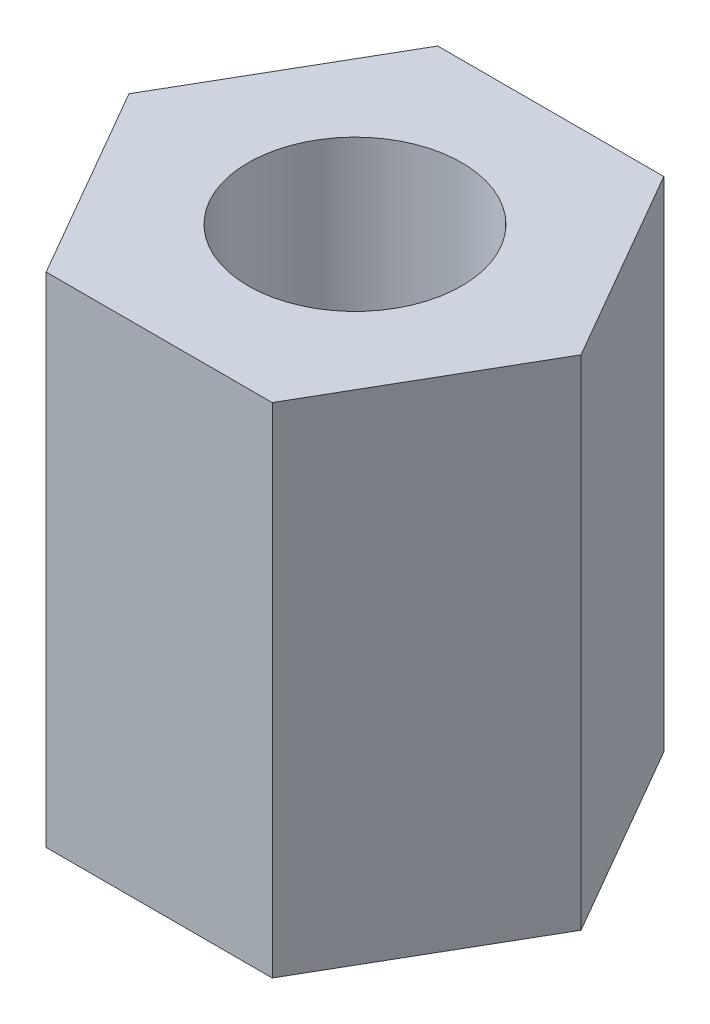
ISO-10303-21;
HEADER;
FILE_DESCRIPTION(('STEP AP214'),'2;1');
FILE_NAME('part.step','',(''),(''),'','','');
FILE_SCHEMA(('AUTOMOTIVE_DESIGN { 1 0 10303 214 1 1 1 1 }'));
ENDSEC;
DATA;
#1=APPLICATION_CONTEXT('core data for automotive mechanical design processes');
#2=APPLICATION_PROTOCOL_DEFINITION('international standard','automotive_design',2000,#1);
#3=PRODUCT_CONTEXT('',#1,'mechanical');
#4=PRODUCT('Part','Part','',(#3));
#5=PRODUCT_RELATED_PRODUCT_CATEGORY('part','',(#4));
#6=PRODUCT_DEFINITION_FORMATION('','',#4);
#7=PRODUCT_DEFINITION_CONTEXT('part definition',#1,'design');
#8=PRODUCT_DEFINITION('design','',#6,#7);
#9=PRODUCT_DEFINITION_SHAPE('','',#8);
#10=(LENGTH_UNIT() NAMED_UNIT(*) SI_UNIT(.MILLI.,.METRE.));
#11=(NAMED_UNIT(*) PLANE_ANGLE_UNIT() SI_UNIT($,.RADIAN.));
#12=(NAMED_UNIT(*) SI_UNIT($,.STERADIAN.) SOLID_ANGLE_UNIT());
#13=UNCERTAINTY_MEASURE_WITH_UNIT(LENGTH_MEASURE(1.E-05),#10,'distance_accuracy_value','');
#14=(GEOMETRIC_REPRESENTATION_CONTEXT(3) GLOBAL_UNCERTAINTY_ASSIGNED_CONTEXT((#13)) GLOBAL_UNIT_ASSIGNED_CONTEXT((#10,
#11,#12)) REPRESENTATION_CONTEXT('',''));
#15=CARTESIAN_POINT('',(0.,0.,0.));
#16=DIRECTION('',(0.,0.,1.));
#17=DIRECTION('',(1.,0.,0.));
#18=AXIS2_PLACEMENT_3D('',#15,#16,#17);
#19=CARTESIAN_POINT('',(0.,7.,0.));
#20=DIRECTION('',(0.,1.,0.));
#21=DIRECTION('',(0.,0.,1.));
#22=AXIS2_PLACEMENT_3D('',#19,#20,#21);
#23=PLANE('',#22);
#24=DIRECTION('',(0.5,0.,-0.866025403784439));
#25=VECTOR('',#24,1.);
#26=CARTESIAN_POINT('',(1.58771324027147,7.,2.75000000000001));
#27=LINE('',#26,#25);
#28=CARTESIAN_POINT('',(1.58771324027147,7.,2.75000000000001));
#29=VERTEX_POINT('',#28);
#30=CARTESIAN_POINT('',(3.17542648054294,7.,0.));
#31=VERTEX_POINT('',#30);
#32=EDGE_CURVE('E152',#29,#31,#27,.T.);
#33=ORIENTED_EDGE('',*,*,#32,.T.);
#34=DIRECTION('',(-0.499999999999999,0.,-0.866025403784439));
#35=VECTOR('',#34,1.);
#36=CARTESIAN_POINT('',(3.17542648054294,7.,0.));
#37=LINE('',#36,#35);
#38=CARTESIAN_POINT('',(1.58771324027147,7.,-2.75000000000001));
#39=VERTEX_POINT('',#38);
#40=EDGE_CURVE('E100',#31,#39,#37,.T.);
#41=ORIENTED_EDGE('',*,*,#40,.T.);
#42=DIRECTION('',(-1.,0.,0.));
#43=VECTOR('',#42,1.);
#44=CARTESIAN_POINT('',(1.58771324027147,7.,-2.75000000000001));
#45=LINE('',#44,#43);
#46=CARTESIAN_POINT('',(-1.58771324027147,7.,-2.75000000000001));
#47=VERTEX_POINT('',#46);
#48=EDGE_CURVE('E113',#39,#47,#45,.T.);
#49=ORIENTED_EDGE('',*,*,#48,.T.);
#50=DIRECTION('',(-0.5,0.,0.866025403784439));
#51=VECTOR('',#50,1.);
#52=CARTESIAN_POINT('',(-1.58771324027147,7.,-2.75000000000001));
#53=LINE('',#52,#51);
#54=CARTESIAN_POINT('',(-3.17542648054295,7.,0.));
#55=VERTEX_POINT('',#54);
#56=EDGE_CURVE('E107',#47,#55,#53,.T.);
#57=ORIENTED_EDGE('',*,*,#56,.T.);
#58=DIRECTION('',(0.5,0.,0.866025403784439));
#59=VECTOR('',#58,1.);
#60=CARTESIAN_POINT('',(-3.17542648054295,7.,0.));
#61=LINE('',#60,#59);
#62=CARTESIAN_POINT('',(-1.58771324027147,7.,2.75000000000001));
#63=VERTEX_POINT('',#62);
#64=EDGE_CURVE('E111',#55,#63,#61,.T.);
#65=ORIENTED_EDGE('',*,*,#64,.T.);
#66=DIRECTION('',(1.,0.,0.));
#67=VECTOR('',#66,1.);
#68=CARTESIAN_POINT('',(-1.58771324027147,7.,2.75000000000001));
#69=LINE('',#68,#67);
#70=EDGE_CURVE('E63',#63,#29,#69,.T.);
#71=ORIENTED_EDGE('',*,*,#70,.T.);
#72=EDGE_LOOP('',(#33,#41,#49,#57,#65,#71));
#73=FACE_BOUND('',#72,.T.);
#74=CARTESIAN_POINT('',(0.,7.,0.));
#75=DIRECTION('',(0.,1.,0.));
#76=DIRECTION('',(0.,0.,1.));
#77=AXIS2_PLACEMENT_3D('',#74,#75,#76);
#78=CIRCLE('',#77,1.5);
#79=CARTESIAN_POINT('',(0.,7.,1.5));
#80=VERTEX_POINT('',#79);
#81=EDGE_CURVE('E140',#80,#80,#78,.T.);
#82=ORIENTED_EDGE('',*,*,#81,.F.);
#83=EDGE_LOOP('',(#82));
#84=FACE_BOUND('',#83,.T.);
#85=ADVANCED_FACE('F45',(#73,#84),#23,.T.);
#86=CARTESIAN_POINT('',(0.,0.,0.));
#87=DIRECTION('',(0.,1.,0.));
#88=DIRECTION('',(0.,0.,1.));
#89=AXIS2_PLACEMENT_3D('',#86,#87,#88);
#90=PLANE('',#89);
#91=DIRECTION('',(0.5,0.,-0.866025403784439));
#92=VECTOR('',#91,1.);
#93=CARTESIAN_POINT('',(1.58771324027147,0.,2.75000000000001));
#94=LINE('',#93,#92);
#95=CARTESIAN_POINT('',(1.58771324027147,0.,2.75000000000001));
#96=VERTEX_POINT('',#95);
#97=CARTESIAN_POINT('',(3.17542648054294,0.,0.));
#98=VERTEX_POINT('',#97);
#99=EDGE_CURVE('E135',#96,#98,#94,.T.);
#100=ORIENTED_EDGE('',*,*,#99,.F.);
#101=DIRECTION('',(1.,0.,0.));
#102=VECTOR('',#101,1.);
#103=CARTESIAN_POINT('',(-1.58771324027147,0.,2.75000000000001));
#104=LINE('',#103,#102);
#105=CARTESIAN_POINT('',(-1.58771324027147,0.,2.75000000000001));
#106=VERTEX_POINT('',#105);
#107=EDGE_CURVE('E92',#106,#96,#104,.T.);
#108=ORIENTED_EDGE('',*,*,#107,.F.);
#109=DIRECTION('',(0.5,0.,0.866025403784439));
#110=VECTOR('',#109,1.);
#111=CARTESIAN_POINT('',(-3.17542648054295,0.,0.));
#112=LINE('',#111,#110);
#113=CARTESIAN_POINT('',(-3.17542648054295,0.,0.));
#114=VERTEX_POINT('',#113);
#115=EDGE_CURVE('E86',#114,#106,#112,.T.);
#116=ORIENTED_EDGE('',*,*,#115,.F.);
#117=DIRECTION('',(-0.5,0.,0.866025403784439));
#118=VECTOR('',#117,1.);
#119=CARTESIAN_POINT('',(-1.58771324027147,0.,-2.75000000000001));
#120=LINE('',#119,#118);
#121=CARTESIAN_POINT('',(-1.58771324027147,0.,-2.75000000000001));
#122=VERTEX_POINT('',#121);
#123=EDGE_CURVE('E122',#122,#114,#120,.T.);
#124=ORIENTED_EDGE('',*,*,#123,.F.);
#125=DIRECTION('',(-1.,0.,0.));
#126=VECTOR('',#125,1.);
#127=CARTESIAN_POINT('',(1.58771324027147,0.,-2.75000000000001));
#128=LINE('',#127,#126);
#129=CARTESIAN_POINT('',(1.58771324027147,0.,-2.75000000000001));
#130=VERTEX_POINT('',#129);
#131=EDGE_CURVE('E143',#130,#122,#128,.T.);
#132=ORIENTED_EDGE('',*,*,#131,.F.);
#133=DIRECTION('',(-0.499999999999999,0.,-0.866025403784439));
#134=VECTOR('',#133,1.);
#135=CARTESIAN_POINT('',(3.17542648054294,0.,0.));
#136=LINE('',#135,#134);
#137=EDGE_CURVE('E139',#98,#130,#136,.T.);
#138=ORIENTED_EDGE('',*,*,#137,.F.);
#139=EDGE_LOOP('',(#100,#108,#116,#124,#132,#138));
#140=FACE_BOUND('',#139,.T.);
#141=CARTESIAN_POINT('',(0.,0.,0.));
#142=DIRECTION('',(0.,1.,0.));
#143=DIRECTION('',(0.,0.,1.));
#144=AXIS2_PLACEMENT_3D('',#141,#142,#143);
#145=CIRCLE('',#144,1.5);
#146=CARTESIAN_POINT('',(0.,0.,1.5));
#147=VERTEX_POINT('',#146);
#148=EDGE_CURVE('E249',#147,#147,#145,.T.);
#149=ORIENTED_EDGE('',*,*,#148,.T.);
#150=EDGE_LOOP('',(#149));
#151=FACE_BOUND('',#150,.T.);
#152=ADVANCED_FACE('F165',(#140,#151),#90,.F.);
#153=CARTESIAN_POINT('',(1.58771324027147,7.,2.75000000000001));
#154=DIRECTION('',(-0.866025403784439,0.,-0.5));
#155=DIRECTION('',(-0.5,0.,0.866025403784439));
#156=AXIS2_PLACEMENT_3D('',#153,#154,#155);
#157=PLANE('',#156);
#158=ORIENTED_EDGE('',*,*,#99,.T.);
#159=DIRECTION('',(0.,-1.,0.));
#160=VECTOR('',#159,1.);
#161=CARTESIAN_POINT('',(3.17542648054294,7.,0.));
#162=LINE('',#161,#160);
#163=EDGE_CURVE('E11',#31,#98,#162,.T.);
#164=ORIENTED_EDGE('',*,*,#163,.F.);
#165=ORIENTED_EDGE('',*,*,#32,.F.);
#166=DIRECTION('',(0.,-1.,0.));
#167=VECTOR('',#166,1.);
#168=CARTESIAN_POINT('',(1.58771324027147,7.,2.75000000000001));
#169=LINE('',#168,#167);
#170=EDGE_CURVE('E131',#29,#96,#169,.T.);
#171=ORIENTED_EDGE('',*,*,#170,.T.);
#172=EDGE_LOOP('',(#158,#164,#165,#171));
#173=FACE_BOUND('',#172,.T.);
#174=ADVANCED_FACE('F47',(#173),#157,.F.);
#175=CARTESIAN_POINT('',(3.17542648054294,7.,0.));
#176=DIRECTION('',(-0.866025403784439,0.,0.499999999999999));
#177=DIRECTION('',(0.499999999999999,0.,0.866025403784439));
#178=AXIS2_PLACEMENT_3D('',#175,#176,#177);
#179=PLANE('',#178);
#180=ORIENTED_EDGE('',*,*,#137,.T.);
#181=DIRECTION('',(0.,-1.,0.));
#182=VECTOR('',#181,1.);
#183=CARTESIAN_POINT('',(1.58771324027147,7.,-2.75000000000001));
#184=LINE('',#183,#182);
#185=EDGE_CURVE('E55',#39,#130,#184,.T.);
#186=ORIENTED_EDGE('',*,*,#185,.F.);
#187=ORIENTED_EDGE('',*,*,#40,.F.);
#188=ORIENTED_EDGE('',*,*,#163,.T.);
#189=EDGE_LOOP('',(#180,#186,#187,#188));
#190=FACE_BOUND('',#189,.T.);
#191=ADVANCED_FACE('F190',(#190),#179,.F.);
#192=CARTESIAN_POINT('',(1.58771324027147,7.,-2.75000000000001));
#193=DIRECTION('',(0.,0.,1.));
#194=DIRECTION('',(1.,0.,0.));
#195=AXIS2_PLACEMENT_3D('',#192,#193,#194);
#196=PLANE('',#195);
#197=ORIENTED_EDGE('',*,*,#131,.T.);
#198=DIRECTION('',(0.,-1.,0.));
#199=VECTOR('',#198,1.);
#200=CARTESIAN_POINT('',(-1.58771324027147,7.,-2.75000000000001));
#201=LINE('',#200,#199);
#202=EDGE_CURVE('E124',#47,#122,#201,.T.);
#203=ORIENTED_EDGE('',*,*,#202,.F.);
#204=ORIENTED_EDGE('',*,*,#48,.F.);
#205=ORIENTED_EDGE('',*,*,#185,.T.);
#206=EDGE_LOOP('',(#197,#203,#204,#205));
#207=FACE_BOUND('',#206,.T.);
#208=ADVANCED_FACE('F162',(#207),#196,.F.);
#209=CARTESIAN_POINT('',(-1.58771324027147,7.,-2.75000000000001));
#210=DIRECTION('',(0.866025403784439,0.,0.5));
#211=DIRECTION('',(0.5,0.,-0.866025403784439));
#212=AXIS2_PLACEMENT_3D('',#209,#210,#211);
#213=PLANE('',#212);
#214=ORIENTED_EDGE('',*,*,#123,.T.);
#215=DIRECTION('',(0.,-1.,0.));
#216=VECTOR('',#215,1.);
#217=CARTESIAN_POINT('',(-3.17542648054295,7.,0.));
#218=LINE('',#217,#216);
#219=EDGE_CURVE('E119',#55,#114,#218,.T.);
#220=ORIENTED_EDGE('',*,*,#219,.F.);
#221=ORIENTED_EDGE('',*,*,#56,.F.);
#222=ORIENTED_EDGE('',*,*,#202,.T.);
#223=EDGE_LOOP('',(#214,#220,#221,#222));
#224=FACE_BOUND('',#223,.T.);
#225=ADVANCED_FACE('F120',(#224),#213,.F.);
#226=CARTESIAN_POINT('',(-3.17542648054295,7.,0.));
#227=DIRECTION('',(0.866025403784438,0.,-0.5));
#228=DIRECTION('',(-0.5,0.,-0.866025403784439));
#229=AXIS2_PLACEMENT_3D('',#226,#227,#228);
#230=PLANE('',#229);
#231=ORIENTED_EDGE('',*,*,#115,.T.);
#232=DIRECTION('',(0.,-1.,0.));
#233=VECTOR('',#232,1.);
#234=CARTESIAN_POINT('',(-1.58771324027147,7.,2.75000000000001));
#235=LINE('',#234,#233);
#236=EDGE_CURVE('E125',#63,#106,#235,.T.);
#237=ORIENTED_EDGE('',*,*,#236,.F.);
#238=ORIENTED_EDGE('',*,*,#64,.F.);
#239=ORIENTED_EDGE('',*,*,#219,.T.);
#240=EDGE_LOOP('',(#231,#237,#238,#239));
#241=FACE_BOUND('',#240,.T.);
#242=ADVANCED_FACE('F127',(#241),#230,.F.);
#243=CARTESIAN_POINT('',(-1.58771324027147,7.,2.75000000000001));
#244=DIRECTION('',(0.,0.,-1.));
#245=DIRECTION('',(-1.,0.,0.));
#246=AXIS2_PLACEMENT_3D('',#243,#244,#245);
#247=PLANE('',#246);
#248=ORIENTED_EDGE('',*,*,#107,.T.);
#249=ORIENTED_EDGE('',*,*,#170,.F.);
#250=ORIENTED_EDGE('',*,*,#70,.F.);
#251=ORIENTED_EDGE('',*,*,#236,.T.);
#252=EDGE_LOOP('',(#248,#249,#250,#251));
#253=FACE_BOUND('',#252,.T.);
#254=ADVANCED_FACE('F170',(#253),#247,.F.);
#255=CARTESIAN_POINT('',(0.,7.,0.));
#256=DIRECTION('',(0.,-1.,0.));
#257=DIRECTION('',(0.,0.,-1.));
#258=AXIS2_PLACEMENT_3D('',#255,#256,#257);
#259=CYLINDRICAL_SURFACE('',#258,1.5);
#260=ORIENTED_EDGE('',*,*,#81,.T.);
#261=EDGE_LOOP('',(#260));
#262=FACE_BOUND('',#261,.T.);
#263=ORIENTED_EDGE('',*,*,#148,.F.);
#264=EDGE_LOOP('',(#263));
#265=FACE_BOUND('',#264,.T.);
#266=ADVANCED_FACE('F172',(#262,#265),#259,.F.);
#267=CLOSED_SHELL('',(#85,#152,#174,#191,#208,#225,#242,#254,#266));
#268=MANIFOLD_SOLID_BREP('B2',#267);
#269=ADVANCED_BREP_SHAPE_REPRESENTATION('',(#18,#268),#14);
#270=SHAPE_DEFINITION_REPRESENTATION(#9,#269);
ENDSEC;
END-ISO-10303-21;
